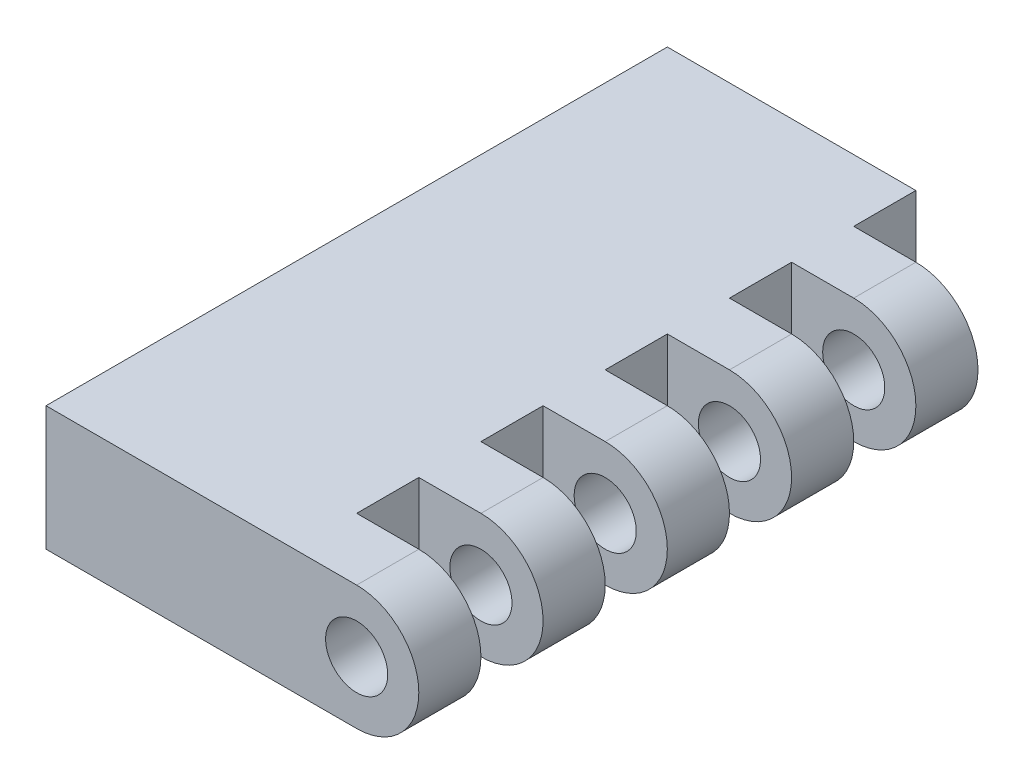
ISO-10303-21;
HEADER;
FILE_DESCRIPTION(('STEP AP214'),'2;1');
FILE_NAME('part.step','',(''),(''),'','','');
FILE_SCHEMA(('AUTOMOTIVE_DESIGN { 1 0 10303 214 1 1 1 1 }'));
ENDSEC;
DATA;
#1=APPLICATION_CONTEXT('core data for automotive mechanical design processes');
#2=APPLICATION_PROTOCOL_DEFINITION('international standard','automotive_design',2000,#1);
#3=PRODUCT_CONTEXT('',#1,'mechanical');
#4=PRODUCT('Part','Part','',(#3));
#5=PRODUCT_RELATED_PRODUCT_CATEGORY('part','',(#4));
#6=PRODUCT_DEFINITION_FORMATION('','',#4);
#7=PRODUCT_DEFINITION_CONTEXT('part definition',#1,'design');
#8=PRODUCT_DEFINITION('design','',#6,#7);
#9=PRODUCT_DEFINITION_SHAPE('','',#8);
#10=(LENGTH_UNIT() NAMED_UNIT(*) SI_UNIT(.MILLI.,.METRE.));
#11=(NAMED_UNIT(*) PLANE_ANGLE_UNIT() SI_UNIT($,.RADIAN.));
#12=(NAMED_UNIT(*) SI_UNIT($,.STERADIAN.) SOLID_ANGLE_UNIT());
#13=UNCERTAINTY_MEASURE_WITH_UNIT(LENGTH_MEASURE(1.E-05),#10,'distance_accuracy_value','');
#14=(GEOMETRIC_REPRESENTATION_CONTEXT(3) GLOBAL_UNCERTAINTY_ASSIGNED_CONTEXT((#13)) GLOBAL_UNIT_ASSIGNED_CONTEXT((#10,
#11,#12)) REPRESENTATION_CONTEXT('',''));
#15=CARTESIAN_POINT('',(0.,0.,0.));
#16=DIRECTION('',(0.,0.,1.));
#17=DIRECTION('',(1.,0.,0.));
#18=AXIS2_PLACEMENT_3D('',#15,#16,#17);
#19=CARTESIAN_POINT('',(0.,0.,2.54));
#20=DIRECTION('',(0.,0.,-1.));
#21=DIRECTION('',(-1.,0.,0.));
#22=AXIS2_PLACEMENT_3D('',#19,#20,#21);
#23=CYLINDRICAL_SURFACE('',#22,0.254);
#24=CARTESIAN_POINT('',(0.,0.,0.254));
#25=DIRECTION('',(0.,0.,1.));
#26=DIRECTION('',(1.,0.,0.));
#27=AXIS2_PLACEMENT_3D('',#24,#25,#26);
#28=CIRCLE('',#27,0.254);
#29=CARTESIAN_POINT('',(0.,-0.254,0.254));
#30=VERTEX_POINT('',#29);
#31=CARTESIAN_POINT('',(0.,0.254,0.254));
#32=VERTEX_POINT('',#31);
#33=EDGE_CURVE('E60',#30,#32,#28,.T.);
#34=ORIENTED_EDGE('',*,*,#33,.T.);
#35=DIRECTION('',(0.,0.,-1.));
#36=VECTOR('',#35,1.);
#37=CARTESIAN_POINT('',(0.,0.254,2.54));
#38=LINE('',#37,#36);
#39=CARTESIAN_POINT('',(0.,0.254,0.508));
#40=VERTEX_POINT('',#39);
#41=EDGE_CURVE('E53',#40,#32,#38,.T.);
#42=ORIENTED_EDGE('',*,*,#41,.F.);
#43=CARTESIAN_POINT('',(0.,0.,0.508));
#44=DIRECTION('',(0.,0.,-1.));
#45=DIRECTION('',(-1.,0.,0.));
#46=AXIS2_PLACEMENT_3D('',#43,#44,#45);
#47=CIRCLE('',#46,0.254);
#48=CARTESIAN_POINT('',(0.,-0.254,0.508));
#49=VERTEX_POINT('',#48);
#50=EDGE_CURVE('E374',#40,#49,#47,.T.);
#51=ORIENTED_EDGE('',*,*,#50,.T.);
#52=DIRECTION('',(0.,0.,-1.));
#53=VECTOR('',#52,1.);
#54=CARTESIAN_POINT('',(0.,-0.254,2.54));
#55=LINE('',#54,#53);
#56=EDGE_CURVE('E397',#49,#30,#55,.T.);
#57=ORIENTED_EDGE('',*,*,#56,.T.);
#58=EDGE_LOOP('',(#34,#42,#51,#57));
#59=FACE_BOUND('',#58,.T.);
#60=ADVANCED_FACE('F41',(#59),#23,.T.);
#61=CARTESIAN_POINT('',(0.,0.,0.762));
#62=DIRECTION('',(0.,0.,1.));
#63=DIRECTION('',(1.,0.,0.));
#64=AXIS2_PLACEMENT_3D('',#61,#62,#63);
#65=CIRCLE('',#64,0.254);
#66=CARTESIAN_POINT('',(0.,-0.254,0.762));
#67=VERTEX_POINT('',#66);
#68=CARTESIAN_POINT('',(0.,0.254,0.762));
#69=VERTEX_POINT('',#68);
#70=EDGE_CURVE('E68',#67,#69,#65,.T.);
#71=ORIENTED_EDGE('',*,*,#70,.T.);
#72=CARTESIAN_POINT('',(0.,0.254,1.016));
#73=VERTEX_POINT('',#72);
#74=EDGE_CURVE('E516',#73,#69,#38,.T.);
#75=ORIENTED_EDGE('',*,*,#74,.F.);
#76=CARTESIAN_POINT('',(0.,0.,1.016));
#77=DIRECTION('',(0.,0.,-1.));
#78=DIRECTION('',(-1.,0.,0.));
#79=AXIS2_PLACEMENT_3D('',#76,#77,#78);
#80=CIRCLE('',#79,0.254);
#81=CARTESIAN_POINT('',(0.,-0.254,1.016));
#82=VERTEX_POINT('',#81);
#83=EDGE_CURVE('E367',#73,#82,#80,.T.);
#84=ORIENTED_EDGE('',*,*,#83,.T.);
#85=EDGE_CURVE('E532',#82,#67,#55,.T.);
#86=ORIENTED_EDGE('',*,*,#85,.T.);
#87=EDGE_LOOP('',(#71,#75,#84,#86));
#88=FACE_BOUND('',#87,.T.);
#89=ADVANCED_FACE('F472',(#88),#23,.T.);
#90=CARTESIAN_POINT('',(0.,0.,1.27));
#91=DIRECTION('',(0.,0.,1.));
#92=DIRECTION('',(1.,0.,0.));
#93=AXIS2_PLACEMENT_3D('',#90,#91,#92);
#94=CIRCLE('',#93,0.254);
#95=CARTESIAN_POINT('',(0.,-0.254,1.27));
#96=VERTEX_POINT('',#95);
#97=CARTESIAN_POINT('',(0.,0.254,1.27));
#98=VERTEX_POINT('',#97);
#99=EDGE_CURVE('E363',#96,#98,#94,.T.);
#100=ORIENTED_EDGE('',*,*,#99,.T.);
#101=CARTESIAN_POINT('',(0.,0.254,1.524));
#102=VERTEX_POINT('',#101);
#103=EDGE_CURVE('E513',#102,#98,#38,.T.);
#104=ORIENTED_EDGE('',*,*,#103,.F.);
#105=CARTESIAN_POINT('',(0.,0.,1.524));
#106=DIRECTION('',(0.,0.,-1.));
#107=DIRECTION('',(-1.,0.,0.));
#108=AXIS2_PLACEMENT_3D('',#105,#106,#107);
#109=CIRCLE('',#108,0.254);
#110=CARTESIAN_POINT('',(0.,-0.254,1.524));
#111=VERTEX_POINT('',#110);
#112=EDGE_CURVE('E359',#102,#111,#109,.T.);
#113=ORIENTED_EDGE('',*,*,#112,.T.);
#114=EDGE_CURVE('E535',#111,#96,#55,.T.);
#115=ORIENTED_EDGE('',*,*,#114,.T.);
#116=EDGE_LOOP('',(#100,#104,#113,#115));
#117=FACE_BOUND('',#116,.T.);
#118=ADVANCED_FACE('F477',(#117),#23,.T.);
#119=CARTESIAN_POINT('',(0.,0.,1.778));
#120=DIRECTION('',(0.,0.,1.));
#121=DIRECTION('',(1.,0.,0.));
#122=AXIS2_PLACEMENT_3D('',#119,#120,#121);
#123=CIRCLE('',#122,0.254);
#124=CARTESIAN_POINT('',(0.,-0.254,1.778));
#125=VERTEX_POINT('',#124);
#126=CARTESIAN_POINT('',(0.,0.254,1.778));
#127=VERTEX_POINT('',#126);
#128=EDGE_CURVE('E355',#125,#127,#123,.T.);
#129=ORIENTED_EDGE('',*,*,#128,.T.);
#130=CARTESIAN_POINT('',(0.,0.254,2.032));
#131=VERTEX_POINT('',#130);
#132=EDGE_CURVE('E51',#131,#127,#38,.T.);
#133=ORIENTED_EDGE('',*,*,#132,.F.);
#134=CARTESIAN_POINT('',(0.,0.,2.032));
#135=DIRECTION('',(0.,0.,-1.));
#136=DIRECTION('',(-1.,0.,0.));
#137=AXIS2_PLACEMENT_3D('',#134,#135,#136);
#138=CIRCLE('',#137,0.254);
#139=CARTESIAN_POINT('',(0.,-0.254,2.032));
#140=VERTEX_POINT('',#139);
#141=EDGE_CURVE('E351',#131,#140,#138,.T.);
#142=ORIENTED_EDGE('',*,*,#141,.T.);
#143=EDGE_CURVE('E410',#140,#125,#55,.T.);
#144=ORIENTED_EDGE('',*,*,#143,.T.);
#145=EDGE_LOOP('',(#129,#133,#142,#144));
#146=FACE_BOUND('',#145,.T.);
#147=ADVANCED_FACE('F483',(#146),#23,.T.);
#148=CARTESIAN_POINT('',(0.,0.,2.54));
#149=DIRECTION('',(0.,0.,1.));
#150=DIRECTION('',(1.,0.,0.));
#151=AXIS2_PLACEMENT_3D('',#148,#149,#150);
#152=PLANE('',#151);
#153=CARTESIAN_POINT('',(0.,0.,2.54));
#154=DIRECTION('',(0.,0.,1.));
#155=DIRECTION('',(1.,0.,0.));
#156=AXIS2_PLACEMENT_3D('',#153,#154,#155);
#157=CIRCLE('',#156,0.254);
#158=CARTESIAN_POINT('',(0.,-0.254,2.54));
#159=VERTEX_POINT('',#158);
#160=CARTESIAN_POINT('',(0.,0.254,2.54));
#161=VERTEX_POINT('',#160);
#162=EDGE_CURVE('E384',#159,#161,#157,.T.);
#163=ORIENTED_EDGE('',*,*,#162,.T.);
#164=DIRECTION('',(-1.,0.,0.));
#165=VECTOR('',#164,1.);
#166=CARTESIAN_POINT('',(0.,0.254,2.54));
#167=LINE('',#166,#165);
#168=CARTESIAN_POINT('',(-1.27,0.254,2.54));
#169=VERTEX_POINT('',#168);
#170=EDGE_CURVE('E388',#161,#169,#167,.T.);
#171=ORIENTED_EDGE('',*,*,#170,.T.);
#172=DIRECTION('',(0.,-1.,0.));
#173=VECTOR('',#172,1.);
#174=CARTESIAN_POINT('',(-1.27,0.254,2.54));
#175=LINE('',#174,#173);
#176=CARTESIAN_POINT('',(-1.27,-0.254,2.54));
#177=VERTEX_POINT('',#176);
#178=EDGE_CURVE('E391',#169,#177,#175,.T.);
#179=ORIENTED_EDGE('',*,*,#178,.T.);
#180=DIRECTION('',(1.,0.,0.));
#181=VECTOR('',#180,1.);
#182=CARTESIAN_POINT('',(-1.27,-0.254,2.54));
#183=LINE('',#182,#181);
#184=EDGE_CURVE('E394',#177,#159,#183,.T.);
#185=ORIENTED_EDGE('',*,*,#184,.T.);
#186=EDGE_LOOP('',(#163,#171,#179,#185));
#187=FACE_BOUND('',#186,.T.);
#188=CARTESIAN_POINT('',(0.,0.,2.54));
#189=DIRECTION('',(0.,0.,1.));
#190=DIRECTION('',(1.,0.,0.));
#191=AXIS2_PLACEMENT_3D('',#188,#189,#190);
#192=CIRCLE('',#191,0.127);
#193=CARTESIAN_POINT('',(0.127,0.,2.54));
#194=VERTEX_POINT('',#193);
#195=EDGE_CURVE('E379',#194,#194,#192,.T.);
#196=ORIENTED_EDGE('',*,*,#195,.F.);
#197=EDGE_LOOP('',(#196));
#198=FACE_BOUND('',#197,.T.);
#199=ADVANCED_FACE('F490',(#187,#198),#152,.T.);
#200=CARTESIAN_POINT('',(0.,0.,0.));
#201=DIRECTION('',(0.,0.,1.));
#202=DIRECTION('',(1.,0.,0.));
#203=AXIS2_PLACEMENT_3D('',#200,#201,#202);
#204=PLANE('',#203);
#205=DIRECTION('',(-1.,0.,0.));
#206=VECTOR('',#205,1.);
#207=CARTESIAN_POINT('',(0.,0.254,0.));
#208=LINE('',#207,#206);
#209=CARTESIAN_POINT('',(-0.254,0.254,0.));
#210=VERTEX_POINT('',#209);
#211=CARTESIAN_POINT('',(-1.27,0.254,0.));
#212=VERTEX_POINT('',#211);
#213=EDGE_CURVE('E383',#210,#212,#208,.T.);
#214=ORIENTED_EDGE('',*,*,#213,.F.);
#215=DIRECTION('',(0.,1.,0.));
#216=VECTOR('',#215,1.);
#217=CARTESIAN_POINT('',(-0.254,-0.254,0.));
#218=LINE('',#217,#216);
#219=CARTESIAN_POINT('',(-0.254,-0.254,0.));
#220=VERTEX_POINT('',#219);
#221=EDGE_CURVE('E204',#220,#210,#218,.T.);
#222=ORIENTED_EDGE('',*,*,#221,.F.);
#223=DIRECTION('',(1.,0.,0.));
#224=VECTOR('',#223,1.);
#225=CARTESIAN_POINT('',(-1.27,-0.254,0.));
#226=LINE('',#225,#224);
#227=CARTESIAN_POINT('',(-1.27,-0.254,0.));
#228=VERTEX_POINT('',#227);
#229=EDGE_CURVE('E217',#228,#220,#226,.T.);
#230=ORIENTED_EDGE('',*,*,#229,.F.);
#231=DIRECTION('',(0.,-1.,0.));
#232=VECTOR('',#231,1.);
#233=CARTESIAN_POINT('',(-1.27,0.254,0.));
#234=LINE('',#233,#232);
#235=EDGE_CURVE('E400',#212,#228,#234,.T.);
#236=ORIENTED_EDGE('',*,*,#235,.F.);
#237=EDGE_LOOP('',(#214,#222,#230,#236));
#238=FACE_BOUND('',#237,.T.);
#239=ADVANCED_FACE('F481',(#238),#204,.F.);
#240=CARTESIAN_POINT('',(0.,0.,2.286));
#241=DIRECTION('',(0.,0.,1.));
#242=DIRECTION('',(1.,0.,0.));
#243=AXIS2_PLACEMENT_3D('',#240,#241,#242);
#244=CIRCLE('',#243,0.254);
#245=CARTESIAN_POINT('',(0.,-0.254,2.286));
#246=VERTEX_POINT('',#245);
#247=CARTESIAN_POINT('',(0.,0.254,2.286));
#248=VERTEX_POINT('',#247);
#249=EDGE_CURVE('E347',#246,#248,#244,.T.);
#250=ORIENTED_EDGE('',*,*,#249,.T.);
#251=EDGE_CURVE('E11',#161,#248,#38,.T.);
#252=ORIENTED_EDGE('',*,*,#251,.F.);
#253=ORIENTED_EDGE('',*,*,#162,.F.);
#254=EDGE_CURVE('E405',#159,#246,#55,.T.);
#255=ORIENTED_EDGE('',*,*,#254,.T.);
#256=EDGE_LOOP('',(#250,#252,#253,#255));
#257=FACE_BOUND('',#256,.T.);
#258=ADVANCED_FACE('F43',(#257),#23,.T.);
#259=CARTESIAN_POINT('',(0.,0.254,2.54));
#260=DIRECTION('',(0.,-1.,0.));
#261=DIRECTION('',(1.,0.,0.));
#262=AXIS2_PLACEMENT_3D('',#259,#260,#261);
#263=PLANE('',#262);
#264=DIRECTION('',(1.,0.,0.));
#265=VECTOR('',#264,1.);
#266=CARTESIAN_POINT('',(-0.254,0.254,0.254));
#267=LINE('',#266,#265);
#268=CARTESIAN_POINT('',(-0.254,0.254,0.254));
#269=VERTEX_POINT('',#268);
#270=EDGE_CURVE('E219',#269,#32,#267,.T.);
#271=ORIENTED_EDGE('',*,*,#270,.F.);
#272=DIRECTION('',(0.,0.,1.));
#273=VECTOR('',#272,1.);
#274=CARTESIAN_POINT('',(-0.254,0.254,0.));
#275=LINE('',#274,#273);
#276=EDGE_CURVE('E201',#210,#269,#275,.T.);
#277=ORIENTED_EDGE('',*,*,#276,.F.);
#278=ORIENTED_EDGE('',*,*,#213,.T.);
#279=DIRECTION('',(0.,0.,-1.));
#280=VECTOR('',#279,1.);
#281=CARTESIAN_POINT('',(-1.27,0.254,2.54));
#282=LINE('',#281,#280);
#283=EDGE_CURVE('E413',#169,#212,#282,.T.);
#284=ORIENTED_EDGE('',*,*,#283,.F.);
#285=ORIENTED_EDGE('',*,*,#170,.F.);
#286=ORIENTED_EDGE('',*,*,#251,.T.);
#287=DIRECTION('',(1.,0.,0.));
#288=VECTOR('',#287,1.);
#289=CARTESIAN_POINT('',(-0.253999999999979,0.254,2.286));
#290=LINE('',#289,#288);
#291=CARTESIAN_POINT('',(-0.253999999999979,0.254,2.286));
#292=VERTEX_POINT('',#291);
#293=EDGE_CURVE('E336',#292,#248,#290,.T.);
#294=ORIENTED_EDGE('',*,*,#293,.F.);
#295=DIRECTION('',(0.,0.,1.));
#296=VECTOR('',#295,1.);
#297=CARTESIAN_POINT('',(-0.253999999999979,0.254,2.032));
#298=LINE('',#297,#296);
#299=CARTESIAN_POINT('',(-0.253999999999979,0.254,2.032));
#300=VERTEX_POINT('',#299);
#301=EDGE_CURVE('E332',#300,#292,#298,.T.);
#302=ORIENTED_EDGE('',*,*,#301,.F.);
#303=DIRECTION('',(-1.,0.,0.));
#304=VECTOR('',#303,1.);
#305=CARTESIAN_POINT('',(-0.253999999999979,0.254,2.032));
#306=LINE('',#305,#304);
#307=EDGE_CURVE('E323',#131,#300,#306,.T.);
#308=ORIENTED_EDGE('',*,*,#307,.F.);
#309=ORIENTED_EDGE('',*,*,#132,.T.);
#310=DIRECTION('',(1.,0.,0.));
#311=VECTOR('',#310,1.);
#312=CARTESIAN_POINT('',(-0.253999999999984,0.254,1.778));
#313=LINE('',#312,#311);
#314=CARTESIAN_POINT('',(-0.253999999999984,0.254,1.778));
#315=VERTEX_POINT('',#314);
#316=EDGE_CURVE('E306',#315,#127,#313,.T.);
#317=ORIENTED_EDGE('',*,*,#316,.F.);
#318=DIRECTION('',(0.,0.,1.));
#319=VECTOR('',#318,1.);
#320=CARTESIAN_POINT('',(-0.253999999999984,0.254,1.524));
#321=LINE('',#320,#319);
#322=CARTESIAN_POINT('',(-0.253999999999984,0.254,1.524));
#323=VERTEX_POINT('',#322);
#324=EDGE_CURVE('E302',#323,#315,#321,.T.);
#325=ORIENTED_EDGE('',*,*,#324,.F.);
#326=DIRECTION('',(-1.,0.,0.));
#327=VECTOR('',#326,1.);
#328=CARTESIAN_POINT('',(-0.253999999999984,0.254,1.524));
#329=LINE('',#328,#327);
#330=EDGE_CURVE('E293',#102,#323,#329,.T.);
#331=ORIENTED_EDGE('',*,*,#330,.F.);
#332=ORIENTED_EDGE('',*,*,#103,.T.);
#333=DIRECTION('',(1.,0.,0.));
#334=VECTOR('',#333,1.);
#335=CARTESIAN_POINT('',(-0.253999999999989,0.254,1.27));
#336=LINE('',#335,#334);
#337=CARTESIAN_POINT('',(-0.253999999999989,0.254,1.27));
#338=VERTEX_POINT('',#337);
#339=EDGE_CURVE('E276',#338,#98,#336,.T.);
#340=ORIENTED_EDGE('',*,*,#339,.F.);
#341=DIRECTION('',(0.,0.,1.));
#342=VECTOR('',#341,1.);
#343=CARTESIAN_POINT('',(-0.253999999999989,0.254,1.016));
#344=LINE('',#343,#342);
#345=CARTESIAN_POINT('',(-0.253999999999989,0.254,1.016));
#346=VERTEX_POINT('',#345);
#347=EDGE_CURVE('E272',#346,#338,#344,.T.);
#348=ORIENTED_EDGE('',*,*,#347,.F.);
#349=DIRECTION('',(-1.,0.,0.));
#350=VECTOR('',#349,1.);
#351=CARTESIAN_POINT('',(-0.253999999999989,0.254,1.016));
#352=LINE('',#351,#350);
#353=EDGE_CURVE('E263',#73,#346,#352,.T.);
#354=ORIENTED_EDGE('',*,*,#353,.F.);
#355=ORIENTED_EDGE('',*,*,#74,.T.);
#356=DIRECTION('',(1.,0.,0.));
#357=VECTOR('',#356,1.);
#358=CARTESIAN_POINT('',(-0.253999999999995,0.254,0.762));
#359=LINE('',#358,#357);
#360=CARTESIAN_POINT('',(-0.253999999999995,0.254,0.762));
#361=VERTEX_POINT('',#360);
#362=EDGE_CURVE('E247',#361,#69,#359,.T.);
#363=ORIENTED_EDGE('',*,*,#362,.F.);
#364=DIRECTION('',(0.,0.,1.));
#365=VECTOR('',#364,1.);
#366=CARTESIAN_POINT('',(-0.253999999999995,0.254,0.508));
#367=LINE('',#366,#365);
#368=CARTESIAN_POINT('',(-0.253999999999995,0.254,0.508));
#369=VERTEX_POINT('',#368);
#370=EDGE_CURVE('E243',#369,#361,#367,.T.);
#371=ORIENTED_EDGE('',*,*,#370,.F.);
#372=DIRECTION('',(-1.,0.,0.));
#373=VECTOR('',#372,1.);
#374=CARTESIAN_POINT('',(-0.253999999999995,0.254,0.508));
#375=LINE('',#374,#373);
#376=EDGE_CURVE('E235',#40,#369,#375,.T.);
#377=ORIENTED_EDGE('',*,*,#376,.F.);
#378=ORIENTED_EDGE('',*,*,#41,.T.);
#379=EDGE_LOOP('',(#271,#277,#278,#284,#285,#286,#294,#302,#308,#309,#317,#325,#331,#332,#340,
#348,#354,#355,#363,#371,#377,#378));
#380=FACE_BOUND('',#379,.T.);
#381=ADVANCED_FACE('F480',(#380),#263,.F.);
#382=CARTESIAN_POINT('',(-1.27,0.254,2.54));
#383=DIRECTION('',(1.,0.,0.));
#384=DIRECTION('',(0.,0.,-1.));
#385=AXIS2_PLACEMENT_3D('',#382,#383,#384);
#386=PLANE('',#385);
#387=ORIENTED_EDGE('',*,*,#235,.T.);
#388=DIRECTION('',(0.,0.,-1.));
#389=VECTOR('',#388,1.);
#390=CARTESIAN_POINT('',(-1.27,-0.254,2.54));
#391=LINE('',#390,#389);
#392=EDGE_CURVE('E409',#177,#228,#391,.T.);
#393=ORIENTED_EDGE('',*,*,#392,.F.);
#394=ORIENTED_EDGE('',*,*,#178,.F.);
#395=ORIENTED_EDGE('',*,*,#283,.T.);
#396=EDGE_LOOP('',(#387,#393,#394,#395));
#397=FACE_BOUND('',#396,.T.);
#398=ADVANCED_FACE('F488',(#397),#386,.F.);
#399=CARTESIAN_POINT('',(-1.27,-0.254,2.54));
#400=DIRECTION('',(0.,1.,0.));
#401=DIRECTION('',(0.,0.,1.));
#402=AXIS2_PLACEMENT_3D('',#399,#400,#401);
#403=PLANE('',#402);
#404=ORIENTED_EDGE('',*,*,#229,.T.);
#405=DIRECTION('',(0.,0.,1.));
#406=VECTOR('',#405,1.);
#407=CARTESIAN_POINT('',(-0.254,-0.254,0.));
#408=LINE('',#407,#406);
#409=CARTESIAN_POINT('',(-0.254,-0.254,0.254));
#410=VERTEX_POINT('',#409);
#411=EDGE_CURVE('E198',#220,#410,#408,.T.);
#412=ORIENTED_EDGE('',*,*,#411,.T.);
#413=DIRECTION('',(1.,0.,0.));
#414=VECTOR('',#413,1.);
#415=CARTESIAN_POINT('',(-0.254,-0.254,0.254));
#416=LINE('',#415,#414);
#417=EDGE_CURVE('E205',#410,#30,#416,.T.);
#418=ORIENTED_EDGE('',*,*,#417,.T.);
#419=ORIENTED_EDGE('',*,*,#56,.F.);
#420=DIRECTION('',(-1.,0.,0.));
#421=VECTOR('',#420,1.);
#422=CARTESIAN_POINT('',(-0.253999999999995,-0.254,0.508));
#423=LINE('',#422,#421);
#424=CARTESIAN_POINT('',(-0.253999999999995,-0.254,0.508));
#425=VERTEX_POINT('',#424);
#426=EDGE_CURVE('E238',#49,#425,#423,.T.);
#427=ORIENTED_EDGE('',*,*,#426,.T.);
#428=DIRECTION('',(0.,0.,1.));
#429=VECTOR('',#428,1.);
#430=CARTESIAN_POINT('',(-0.253999999999995,-0.254,0.508));
#431=LINE('',#430,#429);
#432=CARTESIAN_POINT('',(-0.253999999999994,-0.254,0.762));
#433=VERTEX_POINT('',#432);
#434=EDGE_CURVE('E230',#425,#433,#431,.T.);
#435=ORIENTED_EDGE('',*,*,#434,.T.);
#436=DIRECTION('',(1.,0.,0.));
#437=VECTOR('',#436,1.);
#438=CARTESIAN_POINT('',(-0.253999999999994,-0.254,0.762));
#439=LINE('',#438,#437);
#440=EDGE_CURVE('E234',#433,#67,#439,.T.);
#441=ORIENTED_EDGE('',*,*,#440,.T.);
#442=ORIENTED_EDGE('',*,*,#85,.F.);
#443=DIRECTION('',(-1.,0.,0.));
#444=VECTOR('',#443,1.);
#445=CARTESIAN_POINT('',(-0.253999999999989,-0.254,1.016));
#446=LINE('',#445,#444);
#447=CARTESIAN_POINT('',(-0.253999999999989,-0.254,1.016));
#448=VERTEX_POINT('',#447);
#449=EDGE_CURVE('E267',#82,#448,#446,.T.);
#450=ORIENTED_EDGE('',*,*,#449,.T.);
#451=DIRECTION('',(0.,0.,1.));
#452=VECTOR('',#451,1.);
#453=CARTESIAN_POINT('',(-0.253999999999989,-0.254,1.016));
#454=LINE('',#453,#452);
#455=CARTESIAN_POINT('',(-0.253999999999989,-0.254,1.27));
#456=VERTEX_POINT('',#455);
#457=EDGE_CURVE('E258',#448,#456,#454,.T.);
#458=ORIENTED_EDGE('',*,*,#457,.T.);
#459=DIRECTION('',(1.,0.,0.));
#460=VECTOR('',#459,1.);
#461=CARTESIAN_POINT('',(-0.253999999999989,-0.254,1.27));
#462=LINE('',#461,#460);
#463=EDGE_CURVE('E262',#456,#96,#462,.T.);
#464=ORIENTED_EDGE('',*,*,#463,.T.);
#465=ORIENTED_EDGE('',*,*,#114,.F.);
#466=DIRECTION('',(-1.,0.,0.));
#467=VECTOR('',#466,1.);
#468=CARTESIAN_POINT('',(-0.253999999999984,-0.254,1.524));
#469=LINE('',#468,#467);
#470=CARTESIAN_POINT('',(-0.253999999999984,-0.254,1.524));
#471=VERTEX_POINT('',#470);
#472=EDGE_CURVE('E297',#111,#471,#469,.T.);
#473=ORIENTED_EDGE('',*,*,#472,.T.);
#474=DIRECTION('',(0.,0.,1.));
#475=VECTOR('',#474,1.);
#476=CARTESIAN_POINT('',(-0.253999999999984,-0.254,1.524));
#477=LINE('',#476,#475);
#478=CARTESIAN_POINT('',(-0.253999999999984,-0.254,1.778));
#479=VERTEX_POINT('',#478);
#480=EDGE_CURVE('E288',#471,#479,#477,.T.);
#481=ORIENTED_EDGE('',*,*,#480,.T.);
#482=DIRECTION('',(1.,0.,0.));
#483=VECTOR('',#482,1.);
#484=CARTESIAN_POINT('',(-0.253999999999984,-0.254,1.778));
#485=LINE('',#484,#483);
#486=EDGE_CURVE('E292',#479,#125,#485,.T.);
#487=ORIENTED_EDGE('',*,*,#486,.T.);
#488=ORIENTED_EDGE('',*,*,#143,.F.);
#489=DIRECTION('',(-1.,0.,0.));
#490=VECTOR('',#489,1.);
#491=CARTESIAN_POINT('',(-0.253999999999979,-0.254,2.032));
#492=LINE('',#491,#490);
#493=CARTESIAN_POINT('',(-0.253999999999979,-0.254,2.032));
#494=VERTEX_POINT('',#493);
#495=EDGE_CURVE('E327',#140,#494,#492,.T.);
#496=ORIENTED_EDGE('',*,*,#495,.T.);
#497=DIRECTION('',(0.,0.,1.));
#498=VECTOR('',#497,1.);
#499=CARTESIAN_POINT('',(-0.253999999999979,-0.254,2.032));
#500=LINE('',#499,#498);
#501=CARTESIAN_POINT('',(-0.253999999999979,-0.254,2.286));
#502=VERTEX_POINT('',#501);
#503=EDGE_CURVE('E318',#494,#502,#500,.T.);
#504=ORIENTED_EDGE('',*,*,#503,.T.);
#505=DIRECTION('',(1.,0.,0.));
#506=VECTOR('',#505,1.);
#507=CARTESIAN_POINT('',(-0.253999999999979,-0.254,2.286));
#508=LINE('',#507,#506);
#509=EDGE_CURVE('E322',#502,#246,#508,.T.);
#510=ORIENTED_EDGE('',*,*,#509,.T.);
#511=ORIENTED_EDGE('',*,*,#254,.F.);
#512=ORIENTED_EDGE('',*,*,#184,.F.);
#513=ORIENTED_EDGE('',*,*,#392,.T.);
#514=EDGE_LOOP('',(#404,#412,#418,#419,#427,#435,#441,#442,#450,#458,#464,#465,#473,#481,#487,
#488,#496,#504,#510,#511,#512,#513));
#515=FACE_BOUND('',#514,.T.);
#516=ADVANCED_FACE('F214',(#515),#403,.F.);
#517=CARTESIAN_POINT('',(0.,0.,2.54));
#518=DIRECTION('',(0.,0.,-1.));
#519=DIRECTION('',(-1.,0.,0.));
#520=AXIS2_PLACEMENT_3D('',#517,#518,#519);
#521=CYLINDRICAL_SURFACE('',#520,0.127);
#522=CARTESIAN_POINT('',(0.,0.,2.286));
#523=DIRECTION('',(0.,0.,1.));
#524=DIRECTION('',(1.,0.,0.));
#525=AXIS2_PLACEMENT_3D('',#522,#523,#524);
#526=CIRCLE('',#525,0.127);
#527=CARTESIAN_POINT('',(0.127,0.,2.286));
#528=VERTEX_POINT('',#527);
#529=EDGE_CURVE('E228',#528,#528,#526,.T.);
#530=ORIENTED_EDGE('',*,*,#529,.F.);
#531=EDGE_LOOP('',(#530));
#532=FACE_BOUND('',#531,.T.);
#533=ORIENTED_EDGE('',*,*,#195,.T.);
#534=EDGE_LOOP('',(#533));
#535=FACE_BOUND('',#534,.T.);
#536=ADVANCED_FACE('F450',(#532,#535),#521,.F.);
#537=CARTESIAN_POINT('',(-0.253999999999979,-0.254,2.032));
#538=DIRECTION('',(0.,0.,-1.));
#539=DIRECTION('',(-1.,0.,0.));
#540=AXIS2_PLACEMENT_3D('',#537,#538,#539);
#541=PLANE('',#540);
#542=CARTESIAN_POINT('',(0.,0.,2.032));
#543=DIRECTION('',(0.,0.,-1.));
#544=DIRECTION('',(-1.,0.,0.));
#545=AXIS2_PLACEMENT_3D('',#542,#543,#544);
#546=CIRCLE('',#545,0.127);
#547=CARTESIAN_POINT('',(-0.127,0.,2.032));
#548=VERTEX_POINT('',#547);
#549=EDGE_CURVE('E350',#548,#548,#546,.T.);
#550=ORIENTED_EDGE('',*,*,#549,.T.);
#551=EDGE_LOOP('',(#550));
#552=FACE_BOUND('',#551,.T.);
#553=ORIENTED_EDGE('',*,*,#307,.T.);
#554=DIRECTION('',(0.,1.,0.));
#555=VECTOR('',#554,1.);
#556=CARTESIAN_POINT('',(-0.253999999999979,-0.254,2.032));
#557=LINE('',#556,#555);
#558=EDGE_CURVE('E307',#494,#300,#557,.T.);
#559=ORIENTED_EDGE('',*,*,#558,.F.);
#560=ORIENTED_EDGE('',*,*,#495,.F.);
#561=ORIENTED_EDGE('',*,*,#141,.F.);
#562=EDGE_LOOP('',(#553,#559,#560,#561));
#563=FACE_BOUND('',#562,.T.);
#564=ADVANCED_FACE('F468',(#552,#563),#541,.F.);
#565=CARTESIAN_POINT('',(-0.253999999999979,-0.254,2.286));
#566=DIRECTION('',(0.,0.,1.));
#567=DIRECTION('',(1.,0.,0.));
#568=AXIS2_PLACEMENT_3D('',#565,#566,#567);
#569=PLANE('',#568);
#570=ORIENTED_EDGE('',*,*,#529,.T.);
#571=EDGE_LOOP('',(#570));
#572=FACE_BOUND('',#571,.T.);
#573=ORIENTED_EDGE('',*,*,#249,.F.);
#574=ORIENTED_EDGE('',*,*,#509,.F.);
#575=DIRECTION('',(0.,1.,0.));
#576=VECTOR('',#575,1.);
#577=CARTESIAN_POINT('',(-0.253999999999979,-0.254,2.286));
#578=LINE('',#577,#576);
#579=EDGE_CURVE('E331',#502,#292,#578,.T.);
#580=ORIENTED_EDGE('',*,*,#579,.T.);
#581=ORIENTED_EDGE('',*,*,#293,.T.);
#582=EDGE_LOOP('',(#573,#574,#580,#581));
#583=FACE_BOUND('',#582,.T.);
#584=ADVANCED_FACE('F582',(#572,#583),#569,.F.);
#585=CARTESIAN_POINT('',(-0.253999999999979,-0.254,2.032));
#586=DIRECTION('',(-1.,0.,0.));
#587=DIRECTION('',(0.,0.,1.));
#588=AXIS2_PLACEMENT_3D('',#585,#586,#587);
#589=PLANE('',#588);
#590=ORIENTED_EDGE('',*,*,#301,.T.);
#591=ORIENTED_EDGE('',*,*,#579,.F.);
#592=ORIENTED_EDGE('',*,*,#503,.F.);
#593=ORIENTED_EDGE('',*,*,#558,.T.);
#594=EDGE_LOOP('',(#590,#591,#592,#593));
#595=FACE_BOUND('',#594,.T.);
#596=ADVANCED_FACE('F585',(#595),#589,.F.);
#597=CARTESIAN_POINT('',(0.,0.,1.778));
#598=DIRECTION('',(0.,0.,1.));
#599=DIRECTION('',(1.,0.,0.));
#600=AXIS2_PLACEMENT_3D('',#597,#598,#599);
#601=CIRCLE('',#600,0.127);
#602=CARTESIAN_POINT('',(0.127,0.,1.778));
#603=VERTEX_POINT('',#602);
#604=EDGE_CURVE('E354',#603,#603,#601,.T.);
#605=ORIENTED_EDGE('',*,*,#604,.F.);
#606=EDGE_LOOP('',(#605));
#607=FACE_BOUND('',#606,.T.);
#608=ORIENTED_EDGE('',*,*,#549,.F.);
#609=EDGE_LOOP('',(#608));
#610=FACE_BOUND('',#609,.T.);
#611=ADVANCED_FACE('F470',(#607,#610),#521,.F.);
#612=CARTESIAN_POINT('',(-0.253999999999984,-0.254,1.524));
#613=DIRECTION('',(0.,0.,-1.));
#614=DIRECTION('',(-1.,0.,0.));
#615=AXIS2_PLACEMENT_3D('',#612,#613,#614);
#616=PLANE('',#615);
#617=CARTESIAN_POINT('',(0.,0.,1.524));
#618=DIRECTION('',(0.,0.,-1.));
#619=DIRECTION('',(-1.,0.,0.));
#620=AXIS2_PLACEMENT_3D('',#617,#618,#619);
#621=CIRCLE('',#620,0.127);
#622=CARTESIAN_POINT('',(-0.127,0.,1.524));
#623=VERTEX_POINT('',#622);
#624=EDGE_CURVE('E358',#623,#623,#621,.T.);
#625=ORIENTED_EDGE('',*,*,#624,.T.);
#626=EDGE_LOOP('',(#625));
#627=FACE_BOUND('',#626,.T.);
#628=ORIENTED_EDGE('',*,*,#330,.T.);
#629=DIRECTION('',(0.,1.,0.));
#630=VECTOR('',#629,1.);
#631=CARTESIAN_POINT('',(-0.253999999999984,-0.254,1.524));
#632=LINE('',#631,#630);
#633=EDGE_CURVE('E277',#471,#323,#632,.T.);
#634=ORIENTED_EDGE('',*,*,#633,.F.);
#635=ORIENTED_EDGE('',*,*,#472,.F.);
#636=ORIENTED_EDGE('',*,*,#112,.F.);
#637=EDGE_LOOP('',(#628,#634,#635,#636));
#638=FACE_BOUND('',#637,.T.);
#639=ADVANCED_FACE('F569',(#627,#638),#616,.F.);
#640=CARTESIAN_POINT('',(-0.253999999999984,-0.254,1.778));
#641=DIRECTION('',(0.,0.,1.));
#642=DIRECTION('',(1.,0.,0.));
#643=AXIS2_PLACEMENT_3D('',#640,#641,#642);
#644=PLANE('',#643);
#645=ORIENTED_EDGE('',*,*,#604,.T.);
#646=EDGE_LOOP('',(#645));
#647=FACE_BOUND('',#646,.T.);
#648=ORIENTED_EDGE('',*,*,#128,.F.);
#649=ORIENTED_EDGE('',*,*,#486,.F.);
#650=DIRECTION('',(0.,1.,0.));
#651=VECTOR('',#650,1.);
#652=CARTESIAN_POINT('',(-0.253999999999984,-0.254,1.778));
#653=LINE('',#652,#651);
#654=EDGE_CURVE('E301',#479,#315,#653,.T.);
#655=ORIENTED_EDGE('',*,*,#654,.T.);
#656=ORIENTED_EDGE('',*,*,#316,.T.);
#657=EDGE_LOOP('',(#648,#649,#655,#656));
#658=FACE_BOUND('',#657,.T.);
#659=ADVANCED_FACE('F508',(#647,#658),#644,.F.);
#660=CARTESIAN_POINT('',(-0.253999999999984,-0.254,1.524));
#661=DIRECTION('',(-1.,0.,0.));
#662=DIRECTION('',(0.,0.,1.));
#663=AXIS2_PLACEMENT_3D('',#660,#661,#662);
#664=PLANE('',#663);
#665=ORIENTED_EDGE('',*,*,#324,.T.);
#666=ORIENTED_EDGE('',*,*,#654,.F.);
#667=ORIENTED_EDGE('',*,*,#480,.F.);
#668=ORIENTED_EDGE('',*,*,#633,.T.);
#669=EDGE_LOOP('',(#665,#666,#667,#668));
#670=FACE_BOUND('',#669,.T.);
#671=ADVANCED_FACE('F575',(#670),#664,.F.);
#672=CARTESIAN_POINT('',(0.,0.,1.27));
#673=DIRECTION('',(0.,0.,1.));
#674=DIRECTION('',(1.,0.,0.));
#675=AXIS2_PLACEMENT_3D('',#672,#673,#674);
#676=CIRCLE('',#675,0.127);
#677=CARTESIAN_POINT('',(0.127,0.,1.27));
#678=VERTEX_POINT('',#677);
#679=EDGE_CURVE('E362',#678,#678,#676,.T.);
#680=ORIENTED_EDGE('',*,*,#679,.F.);
#681=EDGE_LOOP('',(#680));
#682=FACE_BOUND('',#681,.T.);
#683=ORIENTED_EDGE('',*,*,#624,.F.);
#684=EDGE_LOOP('',(#683));
#685=FACE_BOUND('',#684,.T.);
#686=ADVANCED_FACE('F466',(#682,#685),#521,.F.);
#687=CARTESIAN_POINT('',(-0.253999999999989,-0.254,1.016));
#688=DIRECTION('',(0.,0.,-1.));
#689=DIRECTION('',(-1.,0.,0.));
#690=AXIS2_PLACEMENT_3D('',#687,#688,#689);
#691=PLANE('',#690);
#692=CARTESIAN_POINT('',(0.,0.,1.016));
#693=DIRECTION('',(0.,0.,-1.));
#694=DIRECTION('',(-1.,0.,0.));
#695=AXIS2_PLACEMENT_3D('',#692,#693,#694);
#696=CIRCLE('',#695,0.127);
#697=CARTESIAN_POINT('',(-0.127,0.,1.016));
#698=VERTEX_POINT('',#697);
#699=EDGE_CURVE('E366',#698,#698,#696,.T.);
#700=ORIENTED_EDGE('',*,*,#699,.T.);
#701=EDGE_LOOP('',(#700));
#702=FACE_BOUND('',#701,.T.);
#703=ORIENTED_EDGE('',*,*,#353,.T.);
#704=DIRECTION('',(0.,1.,0.));
#705=VECTOR('',#704,1.);
#706=CARTESIAN_POINT('',(-0.253999999999989,-0.254,1.016));
#707=LINE('',#706,#705);
#708=EDGE_CURVE('E248',#448,#346,#707,.T.);
#709=ORIENTED_EDGE('',*,*,#708,.F.);
#710=ORIENTED_EDGE('',*,*,#449,.F.);
#711=ORIENTED_EDGE('',*,*,#83,.F.);
#712=EDGE_LOOP('',(#703,#709,#710,#711));
#713=FACE_BOUND('',#712,.T.);
#714=ADVANCED_FACE('F550',(#702,#713),#691,.F.);
#715=CARTESIAN_POINT('',(-0.253999999999989,-0.254,1.27));
#716=DIRECTION('',(0.,0.,1.));
#717=DIRECTION('',(1.,0.,0.));
#718=AXIS2_PLACEMENT_3D('',#715,#716,#717);
#719=PLANE('',#718);
#720=ORIENTED_EDGE('',*,*,#679,.T.);
#721=EDGE_LOOP('',(#720));
#722=FACE_BOUND('',#721,.T.);
#723=ORIENTED_EDGE('',*,*,#99,.F.);
#724=ORIENTED_EDGE('',*,*,#463,.F.);
#725=DIRECTION('',(0.,1.,0.));
#726=VECTOR('',#725,1.);
#727=CARTESIAN_POINT('',(-0.253999999999989,-0.254,1.27));
#728=LINE('',#727,#726);
#729=EDGE_CURVE('E271',#456,#338,#728,.T.);
#730=ORIENTED_EDGE('',*,*,#729,.T.);
#731=ORIENTED_EDGE('',*,*,#339,.T.);
#732=EDGE_LOOP('',(#723,#724,#730,#731));
#733=FACE_BOUND('',#732,.T.);
#734=ADVANCED_FACE('F545',(#722,#733),#719,.F.);
#735=CARTESIAN_POINT('',(-0.253999999999989,-0.254,1.016));
#736=DIRECTION('',(-1.,0.,0.));
#737=DIRECTION('',(0.,0.,1.));
#738=AXIS2_PLACEMENT_3D('',#735,#736,#737);
#739=PLANE('',#738);
#740=ORIENTED_EDGE('',*,*,#347,.T.);
#741=ORIENTED_EDGE('',*,*,#729,.F.);
#742=ORIENTED_EDGE('',*,*,#457,.F.);
#743=ORIENTED_EDGE('',*,*,#708,.T.);
#744=EDGE_LOOP('',(#740,#741,#742,#743));
#745=FACE_BOUND('',#744,.T.);
#746=ADVANCED_FACE('F464',(#745),#739,.F.);
#747=CARTESIAN_POINT('',(0.,0.,0.762));
#748=DIRECTION('',(0.,0.,1.));
#749=DIRECTION('',(1.,0.,0.));
#750=AXIS2_PLACEMENT_3D('',#747,#748,#749);
#751=CIRCLE('',#750,0.127);
#752=CARTESIAN_POINT('',(0.127,0.,0.762));
#753=VERTEX_POINT('',#752);
#754=EDGE_CURVE('E370',#753,#753,#751,.T.);
#755=ORIENTED_EDGE('',*,*,#754,.F.);
#756=EDGE_LOOP('',(#755));
#757=FACE_BOUND('',#756,.T.);
#758=ORIENTED_EDGE('',*,*,#699,.F.);
#759=EDGE_LOOP('',(#758));
#760=FACE_BOUND('',#759,.T.);
#761=ADVANCED_FACE('F449',(#757,#760),#521,.F.);
#762=CARTESIAN_POINT('',(-0.253999999999995,-0.254,0.508));
#763=DIRECTION('',(0.,0.,-1.));
#764=DIRECTION('',(-1.,0.,0.));
#765=AXIS2_PLACEMENT_3D('',#762,#763,#764);
#766=PLANE('',#765);
#767=CARTESIAN_POINT('',(0.,0.,0.508));
#768=DIRECTION('',(0.,0.,-1.));
#769=DIRECTION('',(-1.,0.,0.));
#770=AXIS2_PLACEMENT_3D('',#767,#768,#769);
#771=CIRCLE('',#770,0.127);
#772=CARTESIAN_POINT('',(-0.127,0.,0.508));
#773=VERTEX_POINT('',#772);
#774=EDGE_CURVE('E373',#773,#773,#771,.T.);
#775=ORIENTED_EDGE('',*,*,#774,.T.);
#776=EDGE_LOOP('',(#775));
#777=FACE_BOUND('',#776,.T.);
#778=ORIENTED_EDGE('',*,*,#376,.T.);
#779=DIRECTION('',(0.,1.,0.));
#780=VECTOR('',#779,1.);
#781=CARTESIAN_POINT('',(-0.253999999999995,-0.254,0.508));
#782=LINE('',#781,#780);
#783=EDGE_CURVE('E225',#425,#369,#782,.T.);
#784=ORIENTED_EDGE('',*,*,#783,.F.);
#785=ORIENTED_EDGE('',*,*,#426,.F.);
#786=ORIENTED_EDGE('',*,*,#50,.F.);
#787=EDGE_LOOP('',(#778,#784,#785,#786));
#788=FACE_BOUND('',#787,.T.);
#789=ADVANCED_FACE('F441',(#777,#788),#766,.F.);
#790=CARTESIAN_POINT('',(-0.253999999999994,-0.254,0.762));
#791=DIRECTION('',(0.,0.,1.));
#792=DIRECTION('',(1.,0.,0.));
#793=AXIS2_PLACEMENT_3D('',#790,#791,#792);
#794=PLANE('',#793);
#795=ORIENTED_EDGE('',*,*,#754,.T.);
#796=EDGE_LOOP('',(#795));
#797=FACE_BOUND('',#796,.T.);
#798=ORIENTED_EDGE('',*,*,#70,.F.);
#799=ORIENTED_EDGE('',*,*,#440,.F.);
#800=DIRECTION('',(0.,1.,0.));
#801=VECTOR('',#800,1.);
#802=CARTESIAN_POINT('',(-0.253999999999994,-0.254,0.762));
#803=LINE('',#802,#801);
#804=EDGE_CURVE('E242',#433,#361,#803,.T.);
#805=ORIENTED_EDGE('',*,*,#804,.T.);
#806=ORIENTED_EDGE('',*,*,#362,.T.);
#807=EDGE_LOOP('',(#798,#799,#805,#806));
#808=FACE_BOUND('',#807,.T.);
#809=ADVANCED_FACE('F457',(#797,#808),#794,.F.);
#810=CARTESIAN_POINT('',(-0.253999999999995,-0.254,0.508));
#811=DIRECTION('',(-1.,0.,0.));
#812=DIRECTION('',(0.,0.,1.));
#813=AXIS2_PLACEMENT_3D('',#810,#811,#812);
#814=PLANE('',#813);
#815=ORIENTED_EDGE('',*,*,#370,.T.);
#816=ORIENTED_EDGE('',*,*,#804,.F.);
#817=ORIENTED_EDGE('',*,*,#434,.F.);
#818=ORIENTED_EDGE('',*,*,#783,.T.);
#819=EDGE_LOOP('',(#815,#816,#817,#818));
#820=FACE_BOUND('',#819,.T.);
#821=ADVANCED_FACE('F446',(#820),#814,.F.);
#822=CARTESIAN_POINT('',(0.,0.,0.254));
#823=DIRECTION('',(0.,0.,1.));
#824=DIRECTION('',(1.,0.,0.));
#825=AXIS2_PLACEMENT_3D('',#822,#823,#824);
#826=CIRCLE('',#825,0.127);
#827=CARTESIAN_POINT('',(0.127,0.,0.254));
#828=VERTEX_POINT('',#827);
#829=EDGE_CURVE('E45',#828,#828,#826,.T.);
#830=ORIENTED_EDGE('',*,*,#829,.F.);
#831=EDGE_LOOP('',(#830));
#832=FACE_BOUND('',#831,.T.);
#833=ORIENTED_EDGE('',*,*,#774,.F.);
#834=EDGE_LOOP('',(#833));
#835=FACE_BOUND('',#834,.T.);
#836=ADVANCED_FACE('F444',(#832,#835),#521,.F.);
#837=CARTESIAN_POINT('',(-0.254,-0.254,0.254));
#838=DIRECTION('',(0.,0.,1.));
#839=DIRECTION('',(1.,0.,0.));
#840=AXIS2_PLACEMENT_3D('',#837,#838,#839);
#841=PLANE('',#840);
#842=ORIENTED_EDGE('',*,*,#829,.T.);
#843=EDGE_LOOP('',(#842));
#844=FACE_BOUND('',#843,.T.);
#845=ORIENTED_EDGE('',*,*,#33,.F.);
#846=ORIENTED_EDGE('',*,*,#417,.F.);
#847=DIRECTION('',(0.,1.,0.));
#848=VECTOR('',#847,1.);
#849=CARTESIAN_POINT('',(-0.254,-0.254,0.254));
#850=LINE('',#849,#848);
#851=EDGE_CURVE('E195',#410,#269,#850,.T.);
#852=ORIENTED_EDGE('',*,*,#851,.T.);
#853=ORIENTED_EDGE('',*,*,#270,.T.);
#854=EDGE_LOOP('',(#845,#846,#852,#853));
#855=FACE_BOUND('',#854,.T.);
#856=ADVANCED_FACE('F207',(#844,#855),#841,.F.);
#857=CARTESIAN_POINT('',(-0.254,-0.254,0.));
#858=DIRECTION('',(-1.,0.,0.));
#859=DIRECTION('',(0.,0.,1.));
#860=AXIS2_PLACEMENT_3D('',#857,#858,#859);
#861=PLANE('',#860);
#862=ORIENTED_EDGE('',*,*,#276,.T.);
#863=ORIENTED_EDGE('',*,*,#851,.F.);
#864=ORIENTED_EDGE('',*,*,#411,.F.);
#865=ORIENTED_EDGE('',*,*,#221,.T.);
#866=EDGE_LOOP('',(#862,#863,#864,#865));
#867=FACE_BOUND('',#866,.T.);
#868=ADVANCED_FACE('F196',(#867),#861,.F.);
#869=CLOSED_SHELL('',(#60,#89,#118,#147,#199,#239,#258,#381,#398,#516,#536,#564,#584,#596,#611,
#639,#659,#671,#686,#714,#734,#746,#761,#789,#809,#821,#836,#856,#868));
#870=MANIFOLD_SOLID_BREP('B2',#869);
#871=ADVANCED_BREP_SHAPE_REPRESENTATION('',(#18,#870),#14);
#872=SHAPE_DEFINITION_REPRESENTATION(#9,#871);
ENDSEC;
END-ISO-10303-21;
